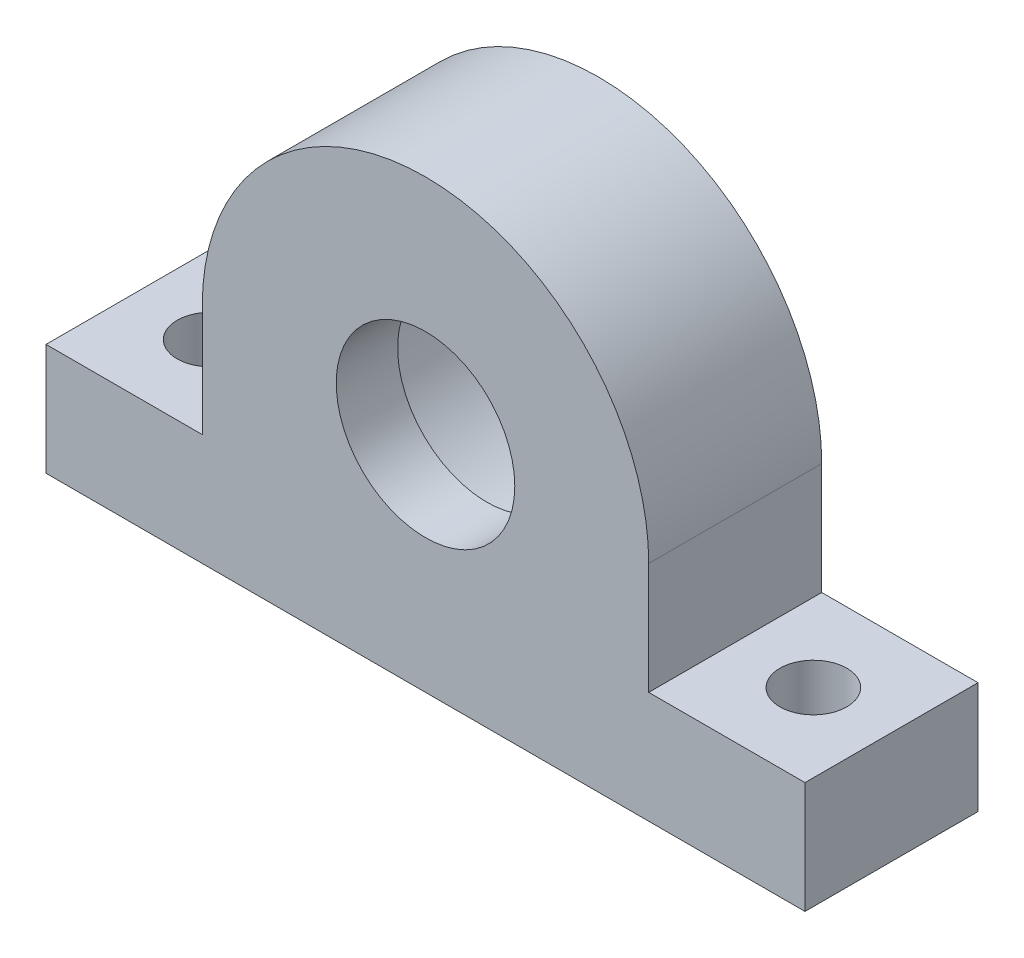
ISO-10303-21;
HEADER;
FILE_DESCRIPTION(('STEP AP214'),'2;1');
FILE_NAME('part.step','',(''),(''),'','','');
FILE_SCHEMA(('AUTOMOTIVE_DESIGN { 1 0 10303 214 1 1 1 1 }'));
ENDSEC;
DATA;
#1=APPLICATION_CONTEXT('core data for automotive mechanical design processes');
#2=APPLICATION_PROTOCOL_DEFINITION('international standard','automotive_design',2000,#1);
#3=PRODUCT_CONTEXT('',#1,'mechanical');
#4=PRODUCT('Part','Part','',(#3));
#5=PRODUCT_RELATED_PRODUCT_CATEGORY('part','',(#4));
#6=PRODUCT_DEFINITION_FORMATION('','',#4);
#7=PRODUCT_DEFINITION_CONTEXT('part definition',#1,'design');
#8=PRODUCT_DEFINITION('design','',#6,#7);
#9=PRODUCT_DEFINITION_SHAPE('','',#8);
#10=(LENGTH_UNIT() NAMED_UNIT(*) SI_UNIT(.MILLI.,.METRE.));
#11=(NAMED_UNIT(*) PLANE_ANGLE_UNIT() SI_UNIT($,.RADIAN.));
#12=(NAMED_UNIT(*) SI_UNIT($,.STERADIAN.) SOLID_ANGLE_UNIT());
#13=UNCERTAINTY_MEASURE_WITH_UNIT(LENGTH_MEASURE(1.E-05),#10,'distance_accuracy_value','');
#14=(GEOMETRIC_REPRESENTATION_CONTEXT(3) GLOBAL_UNCERTAINTY_ASSIGNED_CONTEXT((#13)) GLOBAL_UNIT_ASSIGNED_CONTEXT((#10,
#11,#12)) REPRESENTATION_CONTEXT('',''));
#15=CARTESIAN_POINT('',(0.,0.,0.));
#16=DIRECTION('',(0.,0.,1.));
#17=DIRECTION('',(1.,0.,0.));
#18=AXIS2_PLACEMENT_3D('',#15,#16,#17);
#19=CARTESIAN_POINT('',(0.,20.,0.));
#20=DIRECTION('',(0.,0.,1.));
#21=DIRECTION('',(1.,0.,0.));
#22=AXIS2_PLACEMENT_3D('',#19,#20,#21);
#23=PLANE('',#22);
#24=DIRECTION('',(0.,1.,0.));
#25=VECTOR('',#24,1.);
#26=CARTESIAN_POINT('',(34.,0.,0.));
#27=LINE('',#26,#25);
#28=CARTESIAN_POINT('',(34.,0.,0.));
#29=VERTEX_POINT('',#28);
#30=CARTESIAN_POINT('',(34.,10.,0.));
#31=VERTEX_POINT('',#30);
#32=EDGE_CURVE('E165',#29,#31,#27,.T.);
#33=ORIENTED_EDGE('',*,*,#32,.F.);
#34=DIRECTION('',(1.,0.,0.));
#35=VECTOR('',#34,1.);
#36=CARTESIAN_POINT('',(-34.,0.,0.));
#37=LINE('',#36,#35);
#38=CARTESIAN_POINT('',(-34.,0.,0.));
#39=VERTEX_POINT('',#38);
#40=EDGE_CURVE('E55',#39,#29,#37,.T.);
#41=ORIENTED_EDGE('',*,*,#40,.F.);
#42=DIRECTION('',(0.,-1.,0.));
#43=VECTOR('',#42,1.);
#44=CARTESIAN_POINT('',(-34.,0.,0.));
#45=LINE('',#44,#43);
#46=CARTESIAN_POINT('',(-34.,10.,0.));
#47=VERTEX_POINT('',#46);
#48=EDGE_CURVE('E63',#47,#39,#45,.T.);
#49=ORIENTED_EDGE('',*,*,#48,.F.);
#50=DIRECTION('',(-1.,0.,0.));
#51=VECTOR('',#50,1.);
#52=CARTESIAN_POINT('',(-34.,10.,0.));
#53=LINE('',#52,#51);
#54=CARTESIAN_POINT('',(-20.,10.,0.));
#55=VERTEX_POINT('',#54);
#56=EDGE_CURVE('E180',#55,#47,#53,.T.);
#57=ORIENTED_EDGE('',*,*,#56,.F.);
#58=DIRECTION('',(0.,-1.,0.));
#59=VECTOR('',#58,1.);
#60=CARTESIAN_POINT('',(-20.,10.,0.));
#61=LINE('',#60,#59);
#62=CARTESIAN_POINT('',(-20.,20.,0.));
#63=VERTEX_POINT('',#62);
#64=EDGE_CURVE('E177',#63,#55,#61,.T.);
#65=ORIENTED_EDGE('',*,*,#64,.F.);
#66=CARTESIAN_POINT('',(0.,20.,0.));
#67=DIRECTION('',(0.,0.,1.));
#68=DIRECTION('',(1.,0.,0.));
#69=AXIS2_PLACEMENT_3D('',#66,#67,#68);
#70=CIRCLE('',#69,20.);
#71=CARTESIAN_POINT('',(20.,20.,0.));
#72=VERTEX_POINT('',#71);
#73=EDGE_CURVE('E174',#72,#63,#70,.T.);
#74=ORIENTED_EDGE('',*,*,#73,.F.);
#75=DIRECTION('',(0.,1.,0.));
#76=VECTOR('',#75,1.);
#77=CARTESIAN_POINT('',(20.,10.,0.));
#78=LINE('',#77,#76);
#79=CARTESIAN_POINT('',(20.,10.,0.));
#80=VERTEX_POINT('',#79);
#81=EDGE_CURVE('E171',#80,#72,#78,.T.);
#82=ORIENTED_EDGE('',*,*,#81,.F.);
#83=DIRECTION('',(-1.,0.,0.));
#84=VECTOR('',#83,1.);
#85=CARTESIAN_POINT('',(34.,10.,0.));
#86=LINE('',#85,#84);
#87=EDGE_CURVE('E168',#31,#80,#86,.T.);
#88=ORIENTED_EDGE('',*,*,#87,.F.);
#89=EDGE_LOOP('',(#33,#41,#49,#57,#65,#74,#82,#88));
#90=FACE_BOUND('',#89,.T.);
#91=CARTESIAN_POINT('',(0.,20.,0.));
#92=DIRECTION('',(0.,0.,1.));
#93=DIRECTION('',(1.,0.,0.));
#94=AXIS2_PLACEMENT_3D('',#91,#92,#93);
#95=CIRCLE('',#94,13.05);
#96=CARTESIAN_POINT('',(13.05,20.,0.));
#97=VERTEX_POINT('',#96);
#98=EDGE_CURVE('E161',#97,#97,#95,.T.);
#99=ORIENTED_EDGE('',*,*,#98,.T.);
#100=EDGE_LOOP('',(#99));
#101=FACE_BOUND('',#100,.T.);
#102=ADVANCED_FACE('F39',(#90,#101),#23,.F.);
#103=CARTESIAN_POINT('',(34.,0.,10.));
#104=DIRECTION('',(-1.,0.,0.));
#105=DIRECTION('',(0.,0.,1.));
#106=AXIS2_PLACEMENT_3D('',#103,#104,#105);
#107=PLANE('',#106);
#108=ORIENTED_EDGE('',*,*,#32,.T.);
#109=DIRECTION('',(0.,0.,-1.));
#110=VECTOR('',#109,1.);
#111=CARTESIAN_POINT('',(34.,10.,10.));
#112=LINE('',#111,#110);
#113=CARTESIAN_POINT('',(34.,10.,15.5));
#114=VERTEX_POINT('',#113);
#115=EDGE_CURVE('E11',#114,#31,#112,.T.);
#116=ORIENTED_EDGE('',*,*,#115,.F.);
#117=DIRECTION('',(0.,1.,0.));
#118=VECTOR('',#117,1.);
#119=CARTESIAN_POINT('',(34.,0.,15.5));
#120=LINE('',#119,#118);
#121=CARTESIAN_POINT('',(34.,0.,15.5));
#122=VERTEX_POINT('',#121);
#123=EDGE_CURVE('E116',#122,#114,#120,.T.);
#124=ORIENTED_EDGE('',*,*,#123,.F.);
#125=DIRECTION('',(0.,0.,-1.));
#126=VECTOR('',#125,1.);
#127=CARTESIAN_POINT('',(34.,0.,10.));
#128=LINE('',#127,#126);
#129=EDGE_CURVE('E104',#122,#29,#128,.T.);
#130=ORIENTED_EDGE('',*,*,#129,.T.);
#131=EDGE_LOOP('',(#108,#116,#124,#130));
#132=FACE_BOUND('',#131,.T.);
#133=ADVANCED_FACE('F41',(#132),#107,.F.);
#134=CARTESIAN_POINT('',(34.,10.,10.));
#135=DIRECTION('',(0.,-1.,0.));
#136=DIRECTION('',(1.,0.,0.));
#137=AXIS2_PLACEMENT_3D('',#134,#135,#136);
#138=PLANE('',#137);
#139=CARTESIAN_POINT('',(27.,9.99999999999999,7.75));
#140=DIRECTION('',(0.,1.,0.));
#141=DIRECTION('',(-1.,0.,0.));
#142=AXIS2_PLACEMENT_3D('',#139,#140,#141);
#143=CIRCLE('',#142,3.);
#144=CARTESIAN_POINT('',(24.,9.99999999999999,7.75));
#145=VERTEX_POINT('',#144);
#146=EDGE_CURVE('E271',#145,#145,#143,.T.);
#147=ORIENTED_EDGE('',*,*,#146,.F.);
#148=EDGE_LOOP('',(#147));
#149=FACE_BOUND('',#148,.T.);
#150=ORIENTED_EDGE('',*,*,#87,.T.);
#151=DIRECTION('',(0.,0.,-1.));
#152=VECTOR('',#151,1.);
#153=CARTESIAN_POINT('',(20.,10.,10.));
#154=LINE('',#153,#152);
#155=CARTESIAN_POINT('',(20.,10.,15.5));
#156=VERTEX_POINT('',#155);
#157=EDGE_CURVE('E48',#156,#80,#154,.T.);
#158=ORIENTED_EDGE('',*,*,#157,.F.);
#159=DIRECTION('',(-1.,0.,0.));
#160=VECTOR('',#159,1.);
#161=CARTESIAN_POINT('',(34.,10.,15.5));
#162=LINE('',#161,#160);
#163=EDGE_CURVE('E121',#114,#156,#162,.T.);
#164=ORIENTED_EDGE('',*,*,#163,.F.);
#165=ORIENTED_EDGE('',*,*,#115,.T.);
#166=EDGE_LOOP('',(#150,#158,#164,#165));
#167=FACE_BOUND('',#166,.T.);
#168=ADVANCED_FACE('F241',(#149,#167),#138,.F.);
#169=CARTESIAN_POINT('',(20.,10.,10.));
#170=DIRECTION('',(-1.,0.,0.));
#171=DIRECTION('',(0.,-1.,0.));
#172=AXIS2_PLACEMENT_3D('',#169,#170,#171);
#173=PLANE('',#172);
#174=ORIENTED_EDGE('',*,*,#81,.T.);
#175=DIRECTION('',(0.,0.,-1.));
#176=VECTOR('',#175,1.);
#177=CARTESIAN_POINT('',(20.,20.,10.));
#178=LINE('',#177,#176);
#179=CARTESIAN_POINT('',(20.,20.,15.5));
#180=VERTEX_POINT('',#179);
#181=EDGE_CURVE('E200',#180,#72,#178,.T.);
#182=ORIENTED_EDGE('',*,*,#181,.F.);
#183=DIRECTION('',(0.,1.,0.));
#184=VECTOR('',#183,1.);
#185=CARTESIAN_POINT('',(20.,10.,15.5));
#186=LINE('',#185,#184);
#187=EDGE_CURVE('E140',#156,#180,#186,.T.);
#188=ORIENTED_EDGE('',*,*,#187,.F.);
#189=ORIENTED_EDGE('',*,*,#157,.T.);
#190=EDGE_LOOP('',(#174,#182,#188,#189));
#191=FACE_BOUND('',#190,.T.);
#192=ADVANCED_FACE('F208',(#191),#173,.F.);
#193=CARTESIAN_POINT('',(0.,20.,10.));
#194=DIRECTION('',(0.,0.,-1.));
#195=DIRECTION('',(-1.,0.,0.));
#196=AXIS2_PLACEMENT_3D('',#193,#194,#195);
#197=CYLINDRICAL_SURFACE('',#196,20.);
#198=ORIENTED_EDGE('',*,*,#73,.T.);
#199=DIRECTION('',(0.,0.,-1.));
#200=VECTOR('',#199,1.);
#201=CARTESIAN_POINT('',(-20.,20.,10.));
#202=LINE('',#201,#200);
#203=CARTESIAN_POINT('',(-20.,20.,15.5));
#204=VERTEX_POINT('',#203);
#205=EDGE_CURVE('E196',#204,#63,#202,.T.);
#206=ORIENTED_EDGE('',*,*,#205,.F.);
#207=CARTESIAN_POINT('',(0.,20.,15.5));
#208=DIRECTION('',(0.,0.,1.));
#209=DIRECTION('',(1.,0.,0.));
#210=AXIS2_PLACEMENT_3D('',#207,#208,#209);
#211=CIRCLE('',#210,20.);
#212=EDGE_CURVE('E144',#180,#204,#211,.T.);
#213=ORIENTED_EDGE('',*,*,#212,.F.);
#214=ORIENTED_EDGE('',*,*,#181,.T.);
#215=EDGE_LOOP('',(#198,#206,#213,#214));
#216=FACE_BOUND('',#215,.T.);
#217=ADVANCED_FACE('F216',(#216),#197,.T.);
#218=CARTESIAN_POINT('',(-20.,10.,10.));
#219=DIRECTION('',(1.,0.,0.));
#220=DIRECTION('',(0.,1.,0.));
#221=AXIS2_PLACEMENT_3D('',#218,#219,#220);
#222=PLANE('',#221);
#223=ORIENTED_EDGE('',*,*,#64,.T.);
#224=DIRECTION('',(0.,0.,-1.));
#225=VECTOR('',#224,1.);
#226=CARTESIAN_POINT('',(-20.,10.,10.));
#227=LINE('',#226,#225);
#228=CARTESIAN_POINT('',(-20.,10.,15.5));
#229=VERTEX_POINT('',#228);
#230=EDGE_CURVE('E192',#229,#55,#227,.T.);
#231=ORIENTED_EDGE('',*,*,#230,.F.);
#232=DIRECTION('',(0.,-1.,0.));
#233=VECTOR('',#232,1.);
#234=CARTESIAN_POINT('',(-20.,20.,15.5));
#235=LINE('',#234,#233);
#236=EDGE_CURVE('E148',#204,#229,#235,.T.);
#237=ORIENTED_EDGE('',*,*,#236,.F.);
#238=ORIENTED_EDGE('',*,*,#205,.T.);
#239=EDGE_LOOP('',(#223,#231,#237,#238));
#240=FACE_BOUND('',#239,.T.);
#241=ADVANCED_FACE('F220',(#240),#222,.F.);
#242=CARTESIAN_POINT('',(-34.,10.,10.));
#243=DIRECTION('',(0.,-1.,0.));
#244=DIRECTION('',(1.,0.,0.));
#245=AXIS2_PLACEMENT_3D('',#242,#243,#244);
#246=PLANE('',#245);
#247=CARTESIAN_POINT('',(-27.,9.99999999999999,7.75));
#248=DIRECTION('',(0.,1.,0.));
#249=DIRECTION('',(-1.,0.,0.));
#250=AXIS2_PLACEMENT_3D('',#247,#248,#249);
#251=CIRCLE('',#250,3.);
#252=CARTESIAN_POINT('',(-30.,9.99999999999999,7.75));
#253=VERTEX_POINT('',#252);
#254=EDGE_CURVE('E280',#253,#253,#251,.T.);
#255=ORIENTED_EDGE('',*,*,#254,.F.);
#256=EDGE_LOOP('',(#255));
#257=FACE_BOUND('',#256,.T.);
#258=ORIENTED_EDGE('',*,*,#56,.T.);
#259=DIRECTION('',(0.,0.,-1.));
#260=VECTOR('',#259,1.);
#261=CARTESIAN_POINT('',(-34.,10.,10.));
#262=LINE('',#261,#260);
#263=CARTESIAN_POINT('',(-34.,10.,15.5));
#264=VERTEX_POINT('',#263);
#265=EDGE_CURVE('E189',#264,#47,#262,.T.);
#266=ORIENTED_EDGE('',*,*,#265,.F.);
#267=DIRECTION('',(-1.,0.,0.));
#268=VECTOR('',#267,1.);
#269=CARTESIAN_POINT('',(-20.,10.,15.5));
#270=LINE('',#269,#268);
#271=EDGE_CURVE('E152',#229,#264,#270,.T.);
#272=ORIENTED_EDGE('',*,*,#271,.F.);
#273=ORIENTED_EDGE('',*,*,#230,.T.);
#274=EDGE_LOOP('',(#258,#266,#272,#273));
#275=FACE_BOUND('',#274,.T.);
#276=ADVANCED_FACE('F223',(#257,#275),#246,.F.);
#277=CARTESIAN_POINT('',(-34.,0.,10.));
#278=DIRECTION('',(1.,0.,0.));
#279=DIRECTION('',(0.,0.,-1.));
#280=AXIS2_PLACEMENT_3D('',#277,#278,#279);
#281=PLANE('',#280);
#282=ORIENTED_EDGE('',*,*,#48,.T.);
#283=DIRECTION('',(0.,0.,-1.));
#284=VECTOR('',#283,1.);
#285=CARTESIAN_POINT('',(-34.,0.,10.));
#286=LINE('',#285,#284);
#287=CARTESIAN_POINT('',(-34.,0.,15.5));
#288=VERTEX_POINT('',#287);
#289=EDGE_CURVE('E113',#288,#39,#286,.T.);
#290=ORIENTED_EDGE('',*,*,#289,.F.);
#291=DIRECTION('',(0.,-1.,0.));
#292=VECTOR('',#291,1.);
#293=CARTESIAN_POINT('',(-34.,10.,15.5));
#294=LINE('',#293,#292);
#295=EDGE_CURVE('E128',#264,#288,#294,.T.);
#296=ORIENTED_EDGE('',*,*,#295,.F.);
#297=ORIENTED_EDGE('',*,*,#265,.T.);
#298=EDGE_LOOP('',(#282,#290,#296,#297));
#299=FACE_BOUND('',#298,.T.);
#300=ADVANCED_FACE('F224',(#299),#281,.F.);
#301=CARTESIAN_POINT('',(-34.,0.,10.));
#302=DIRECTION('',(0.,1.,0.));
#303=DIRECTION('',(0.,0.,1.));
#304=AXIS2_PLACEMENT_3D('',#301,#302,#303);
#305=PLANE('',#304);
#306=CARTESIAN_POINT('',(27.,0.,7.75));
#307=DIRECTION('',(0.,1.,0.));
#308=DIRECTION('',(-1.,0.,0.));
#309=AXIS2_PLACEMENT_3D('',#306,#307,#308);
#310=CIRCLE('',#309,3.);
#311=CARTESIAN_POINT('',(24.,0.,7.75));
#312=VERTEX_POINT('',#311);
#313=EDGE_CURVE('E268',#312,#312,#310,.T.);
#314=ORIENTED_EDGE('',*,*,#313,.T.);
#315=EDGE_LOOP('',(#314));
#316=FACE_BOUND('',#315,.T.);
#317=CARTESIAN_POINT('',(-27.,0.,7.75));
#318=DIRECTION('',(0.,1.,0.));
#319=DIRECTION('',(-1.,0.,0.));
#320=AXIS2_PLACEMENT_3D('',#317,#318,#319);
#321=CIRCLE('',#320,3.);
#322=CARTESIAN_POINT('',(-30.,0.,7.75));
#323=VERTEX_POINT('',#322);
#324=EDGE_CURVE('E274',#323,#323,#321,.T.);
#325=ORIENTED_EDGE('',*,*,#324,.T.);
#326=EDGE_LOOP('',(#325));
#327=FACE_BOUND('',#326,.T.);
#328=ORIENTED_EDGE('',*,*,#40,.T.);
#329=ORIENTED_EDGE('',*,*,#129,.F.);
#330=DIRECTION('',(1.,0.,0.));
#331=VECTOR('',#330,1.);
#332=CARTESIAN_POINT('',(-34.,0.,15.5));
#333=LINE('',#332,#331);
#334=EDGE_CURVE('E108',#288,#122,#333,.T.);
#335=ORIENTED_EDGE('',*,*,#334,.F.);
#336=ORIENTED_EDGE('',*,*,#289,.T.);
#337=EDGE_LOOP('',(#328,#329,#335,#336));
#338=FACE_BOUND('',#337,.T.);
#339=ADVANCED_FACE('F106',(#316,#327,#338),#305,.F.);
#340=CARTESIAN_POINT('',(0.,20.,10.));
#341=DIRECTION('',(0.,0.,-1.));
#342=DIRECTION('',(-1.,0.,0.));
#343=AXIS2_PLACEMENT_3D('',#340,#341,#342);
#344=CYLINDRICAL_SURFACE('',#343,13.05);
#345=CARTESIAN_POINT('',(0.,20.,10.));
#346=DIRECTION('',(0.,0.,1.));
#347=DIRECTION('',(1.,0.,0.));
#348=AXIS2_PLACEMENT_3D('',#345,#346,#347);
#349=CIRCLE('',#348,13.05);
#350=CARTESIAN_POINT('',(13.05,20.,10.));
#351=VERTEX_POINT('',#350);
#352=EDGE_CURVE('E157',#351,#351,#349,.T.);
#353=ORIENTED_EDGE('',*,*,#352,.T.);
#354=EDGE_LOOP('',(#353));
#355=FACE_BOUND('',#354,.T.);
#356=ORIENTED_EDGE('',*,*,#98,.F.);
#357=EDGE_LOOP('',(#356));
#358=FACE_BOUND('',#357,.T.);
#359=ADVANCED_FACE('F231',(#355,#358),#344,.F.);
#360=CARTESIAN_POINT('',(0.,20.,10.));
#361=DIRECTION('',(0.,0.,1.));
#362=DIRECTION('',(1.,0.,0.));
#363=AXIS2_PLACEMENT_3D('',#360,#361,#362);
#364=PLANE('',#363);
#365=CARTESIAN_POINT('',(0.,20.,10.));
#366=DIRECTION('',(0.,0.,1.));
#367=DIRECTION('',(1.,0.,0.));
#368=AXIS2_PLACEMENT_3D('',#365,#366,#367);
#369=CIRCLE('',#368,8.);
#370=CARTESIAN_POINT('',(8.,20.,10.));
#371=VERTEX_POINT('',#370);
#372=EDGE_CURVE('E134',#371,#371,#369,.T.);
#373=ORIENTED_EDGE('',*,*,#372,.T.);
#374=EDGE_LOOP('',(#373));
#375=FACE_BOUND('',#374,.T.);
#376=ORIENTED_EDGE('',*,*,#352,.F.);
#377=EDGE_LOOP('',(#376));
#378=FACE_BOUND('',#377,.T.);
#379=ADVANCED_FACE('F245',(#375,#378),#364,.F.);
#380=CARTESIAN_POINT('',(0.,20.,15.5));
#381=DIRECTION('',(0.,0.,1.));
#382=DIRECTION('',(1.,0.,0.));
#383=AXIS2_PLACEMENT_3D('',#380,#381,#382);
#384=PLANE('',#383);
#385=ORIENTED_EDGE('',*,*,#334,.T.);
#386=ORIENTED_EDGE('',*,*,#123,.T.);
#387=ORIENTED_EDGE('',*,*,#163,.T.);
#388=ORIENTED_EDGE('',*,*,#187,.T.);
#389=ORIENTED_EDGE('',*,*,#212,.T.);
#390=ORIENTED_EDGE('',*,*,#236,.T.);
#391=ORIENTED_EDGE('',*,*,#271,.T.);
#392=ORIENTED_EDGE('',*,*,#295,.T.);
#393=EDGE_LOOP('',(#385,#386,#387,#388,#389,#390,#391,#392));
#394=FACE_BOUND('',#393,.T.);
#395=CARTESIAN_POINT('',(0.,20.,15.5));
#396=DIRECTION('',(0.,0.,1.));
#397=DIRECTION('',(1.,0.,0.));
#398=AXIS2_PLACEMENT_3D('',#395,#396,#397);
#399=CIRCLE('',#398,8.);
#400=CARTESIAN_POINT('',(8.,20.,15.5));
#401=VERTEX_POINT('',#400);
#402=EDGE_CURVE('E130',#401,#401,#399,.T.);
#403=ORIENTED_EDGE('',*,*,#402,.F.);
#404=EDGE_LOOP('',(#403));
#405=FACE_BOUND('',#404,.T.);
#406=ADVANCED_FACE('F124',(#394,#405),#384,.T.);
#407=CARTESIAN_POINT('',(0.,20.,15.5));
#408=DIRECTION('',(0.,0.,-1.));
#409=DIRECTION('',(-1.,0.,0.));
#410=AXIS2_PLACEMENT_3D('',#407,#408,#409);
#411=CYLINDRICAL_SURFACE('',#410,8.);
#412=ORIENTED_EDGE('',*,*,#402,.T.);
#413=EDGE_LOOP('',(#412));
#414=FACE_BOUND('',#413,.T.);
#415=ORIENTED_EDGE('',*,*,#372,.F.);
#416=EDGE_LOOP('',(#415));
#417=FACE_BOUND('',#416,.T.);
#418=ADVANCED_FACE('F252',(#414,#417),#411,.F.);
#419=CARTESIAN_POINT('',(-27.,0.,7.75));
#420=DIRECTION('',(0.,1.,0.));
#421=DIRECTION('',(-1.,0.,0.));
#422=AXIS2_PLACEMENT_3D('',#419,#420,#421);
#423=CYLINDRICAL_SURFACE('',#422,3.);
#424=ORIENTED_EDGE('',*,*,#324,.F.);
#425=EDGE_LOOP('',(#424));
#426=FACE_BOUND('',#425,.T.);
#427=ORIENTED_EDGE('',*,*,#254,.T.);
#428=EDGE_LOOP('',(#427));
#429=FACE_BOUND('',#428,.T.);
#430=ADVANCED_FACE('F255',(#426,#429),#423,.F.);
#431=CARTESIAN_POINT('',(27.,0.,7.75));
#432=DIRECTION('',(0.,1.,0.));
#433=DIRECTION('',(-1.,0.,0.));
#434=AXIS2_PLACEMENT_3D('',#431,#432,#433);
#435=CYLINDRICAL_SURFACE('',#434,3.);
#436=ORIENTED_EDGE('',*,*,#313,.F.);
#437=EDGE_LOOP('',(#436));
#438=FACE_BOUND('',#437,.T.);
#439=ORIENTED_EDGE('',*,*,#146,.T.);
#440=EDGE_LOOP('',(#439));
#441=FACE_BOUND('',#440,.T.);
#442=ADVANCED_FACE('F259',(#438,#441),#435,.F.);
#443=CLOSED_SHELL('',(#102,#133,#168,#192,#217,#241,#276,#300,#339,#359,#379,#406,#418,#430,#442));
#444=MANIFOLD_SOLID_BREP('B2',#443);
#445=ADVANCED_BREP_SHAPE_REPRESENTATION('',(#18,#444),#14);
#446=SHAPE_DEFINITION_REPRESENTATION(#9,#445);
ENDSEC;
END-ISO-10303-21;
